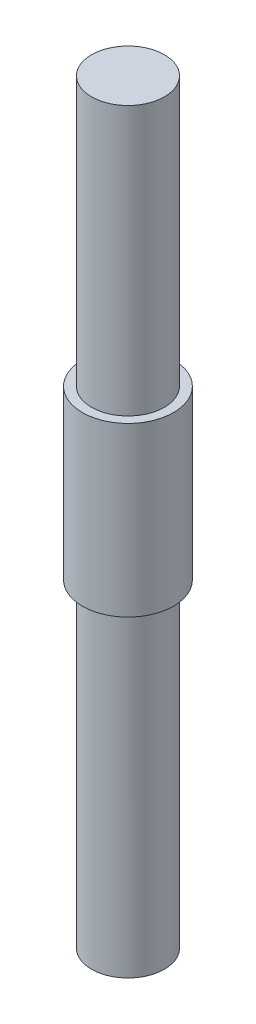
ISO-10303-21;
HEADER;
FILE_DESCRIPTION(('STEP AP214'),'2;1');
FILE_NAME('part.step','',(''),(''),'','','');
FILE_SCHEMA(('AUTOMOTIVE_DESIGN { 1 0 10303 214 1 1 1 1 }'));
ENDSEC;
DATA;
#1=APPLICATION_CONTEXT('core data for automotive mechanical design processes');
#2=APPLICATION_PROTOCOL_DEFINITION('international standard','automotive_design',2000,#1);
#3=PRODUCT_CONTEXT('',#1,'mechanical');
#4=PRODUCT('Part','Part','',(#3));
#5=PRODUCT_RELATED_PRODUCT_CATEGORY('part','',(#4));
#6=PRODUCT_DEFINITION_FORMATION('','',#4);
#7=PRODUCT_DEFINITION_CONTEXT('part definition',#1,'design');
#8=PRODUCT_DEFINITION('design','',#6,#7);
#9=PRODUCT_DEFINITION_SHAPE('','',#8);
#10=(LENGTH_UNIT() NAMED_UNIT(*) SI_UNIT(.MILLI.,.METRE.));
#11=(NAMED_UNIT(*) PLANE_ANGLE_UNIT() SI_UNIT($,.RADIAN.));
#12=(NAMED_UNIT(*) SI_UNIT($,.STERADIAN.) SOLID_ANGLE_UNIT());
#13=UNCERTAINTY_MEASURE_WITH_UNIT(LENGTH_MEASURE(1.E-05),#10,'distance_accuracy_value','');
#14=(GEOMETRIC_REPRESENTATION_CONTEXT(3) GLOBAL_UNCERTAINTY_ASSIGNED_CONTEXT((#13)) GLOBAL_UNIT_ASSIGNED_CONTEXT((#10,
#11,#12)) REPRESENTATION_CONTEXT('',''));
#15=CARTESIAN_POINT('',(0.,0.,0.));
#16=DIRECTION('',(0.,0.,1.));
#17=DIRECTION('',(1.,0.,0.));
#18=AXIS2_PLACEMENT_3D('',#15,#16,#17);
#19=CARTESIAN_POINT('',(0.,18.4,0.));
#20=DIRECTION('',(0.,-1.,0.));
#21=DIRECTION('',(0.,0.,-1.));
#22=AXIS2_PLACEMENT_3D('',#19,#20,#21);
#23=CYLINDRICAL_SURFACE('',#22,5.);
#24=CARTESIAN_POINT('',(0.,18.4,0.));
#25=DIRECTION('',(0.,1.,0.));
#26=DIRECTION('',(0.,0.,1.));
#27=AXIS2_PLACEMENT_3D('',#24,#25,#26);
#28=CIRCLE('',#27,5.);
#29=CARTESIAN_POINT('',(0.,18.4,5.));
#30=VERTEX_POINT('',#29);
#31=EDGE_CURVE('E36',#30,#30,#28,.T.);
#32=ORIENTED_EDGE('',*,*,#31,.F.);
#33=EDGE_LOOP('',(#32));
#34=FACE_BOUND('',#33,.T.);
#35=CARTESIAN_POINT('',(0.,0.,0.));
#36=DIRECTION('',(0.,1.,0.));
#37=DIRECTION('',(0.,0.,1.));
#38=AXIS2_PLACEMENT_3D('',#35,#36,#37);
#39=CIRCLE('',#38,5.);
#40=CARTESIAN_POINT('',(0.,0.,5.));
#41=VERTEX_POINT('',#40);
#42=EDGE_CURVE('E40',#41,#41,#39,.T.);
#43=ORIENTED_EDGE('',*,*,#42,.T.);
#44=EDGE_LOOP('',(#43));
#45=FACE_BOUND('',#44,.T.);
#46=ADVANCED_FACE('F30',(#34,#45),#23,.T.);
#47=CARTESIAN_POINT('',(0.,18.4,0.));
#48=DIRECTION('',(0.,1.,0.));
#49=DIRECTION('',(0.,0.,1.));
#50=AXIS2_PLACEMENT_3D('',#47,#48,#49);
#51=PLANE('',#50);
#52=CARTESIAN_POINT('',(0.,18.4,0.));
#53=DIRECTION('',(0.,1.,0.));
#54=DIRECTION('',(0.,0.,1.));
#55=AXIS2_PLACEMENT_3D('',#52,#53,#54);
#56=CIRCLE('',#55,4.);
#57=CARTESIAN_POINT('',(0.,18.4,4.));
#58=VERTEX_POINT('',#57);
#59=EDGE_CURVE('E47',#58,#58,#56,.T.);
#60=ORIENTED_EDGE('',*,*,#59,.F.);
#61=EDGE_LOOP('',(#60));
#62=FACE_BOUND('',#61,.T.);
#63=ORIENTED_EDGE('',*,*,#31,.T.);
#64=EDGE_LOOP('',(#63));
#65=FACE_BOUND('',#64,.T.);
#66=ADVANCED_FACE('F71',(#62,#65),#51,.T.);
#67=CARTESIAN_POINT('',(0.,0.,0.));
#68=DIRECTION('',(0.,1.,0.));
#69=DIRECTION('',(0.,0.,1.));
#70=AXIS2_PLACEMENT_3D('',#67,#68,#69);
#71=PLANE('',#70);
#72=CARTESIAN_POINT('',(0.,0.,0.));
#73=DIRECTION('',(0.,1.,0.));
#74=DIRECTION('',(0.,0.,1.));
#75=AXIS2_PLACEMENT_3D('',#72,#73,#74);
#76=CIRCLE('',#75,4.);
#77=CARTESIAN_POINT('',(0.,0.,4.));
#78=VERTEX_POINT('',#77);
#79=EDGE_CURVE('E10',#78,#78,#76,.F.);
#80=ORIENTED_EDGE('',*,*,#79,.F.);
#81=EDGE_LOOP('',(#80));
#82=FACE_BOUND('',#81,.T.);
#83=ORIENTED_EDGE('',*,*,#42,.F.);
#84=EDGE_LOOP('',(#83));
#85=FACE_BOUND('',#84,.T.);
#86=ADVANCED_FACE('F76',(#82,#85),#71,.F.);
#87=CARTESIAN_POINT('',(0.,47.9,0.));
#88=DIRECTION('',(0.,-1.,0.));
#89=DIRECTION('',(0.,0.,-1.));
#90=AXIS2_PLACEMENT_3D('',#87,#88,#89);
#91=CYLINDRICAL_SURFACE('',#90,4.);
#92=CARTESIAN_POINT('',(0.,47.9,0.));
#93=DIRECTION('',(0.,1.,0.));
#94=DIRECTION('',(0.,0.,1.));
#95=AXIS2_PLACEMENT_3D('',#92,#93,#94);
#96=CIRCLE('',#95,4.);
#97=CARTESIAN_POINT('',(0.,47.9,4.));
#98=VERTEX_POINT('',#97);
#99=EDGE_CURVE('E45',#98,#98,#96,.T.);
#100=ORIENTED_EDGE('',*,*,#99,.F.);
#101=EDGE_LOOP('',(#100));
#102=FACE_BOUND('',#101,.T.);
#103=ORIENTED_EDGE('',*,*,#59,.T.);
#104=EDGE_LOOP('',(#103));
#105=FACE_BOUND('',#104,.T.);
#106=ADVANCED_FACE('F67',(#102,#105),#91,.T.);
#107=CARTESIAN_POINT('',(0.,47.9,0.));
#108=DIRECTION('',(0.,1.,0.));
#109=DIRECTION('',(0.,0.,1.));
#110=AXIS2_PLACEMENT_3D('',#107,#108,#109);
#111=PLANE('',#110);
#112=ORIENTED_EDGE('',*,*,#99,.T.);
#113=EDGE_LOOP('',(#112));
#114=FACE_BOUND('',#113,.T.);
#115=ADVANCED_FACE('F60',(#114),#111,.T.);
#116=CARTESIAN_POINT('',(0.,-35.,0.));
#117=DIRECTION('',(0.,1.,0.));
#118=DIRECTION('',(0.,0.,1.));
#119=AXIS2_PLACEMENT_3D('',#116,#117,#118);
#120=CYLINDRICAL_SURFACE('',#119,4.);
#121=CARTESIAN_POINT('',(0.,-35.,0.));
#122=DIRECTION('',(0.,-1.,0.));
#123=DIRECTION('',(0.,0.,-1.));
#124=AXIS2_PLACEMENT_3D('',#121,#122,#123);
#125=CIRCLE('',#124,4.);
#126=CARTESIAN_POINT('',(0.,-35.,-4.));
#127=VERTEX_POINT('',#126);
#128=EDGE_CURVE('E50',#127,#127,#125,.T.);
#129=ORIENTED_EDGE('',*,*,#128,.F.);
#130=EDGE_LOOP('',(#129));
#131=FACE_BOUND('',#130,.T.);
#132=ORIENTED_EDGE('',*,*,#79,.T.);
#133=EDGE_LOOP('',(#132));
#134=FACE_BOUND('',#133,.T.);
#135=ADVANCED_FACE('F58',(#131,#134),#120,.T.);
#136=CARTESIAN_POINT('',(0.,-35.,0.));
#137=DIRECTION('',(0.,-1.,0.));
#138=DIRECTION('',(0.,0.,-1.));
#139=AXIS2_PLACEMENT_3D('',#136,#137,#138);
#140=PLANE('',#139);
#141=ORIENTED_EDGE('',*,*,#128,.T.);
#142=EDGE_LOOP('',(#141));
#143=FACE_BOUND('',#142,.T.);
#144=ADVANCED_FACE('F56',(#143),#140,.T.);
#145=CLOSED_SHELL('',(#46,#66,#86,#106,#115,#135,#144));
#146=MANIFOLD_SOLID_BREP('B2',#145);
#147=ADVANCED_BREP_SHAPE_REPRESENTATION('',(#18,#146),#14);
#148=SHAPE_DEFINITION_REPRESENTATION(#9,#147);
ENDSEC;
END-ISO-10303-21;
